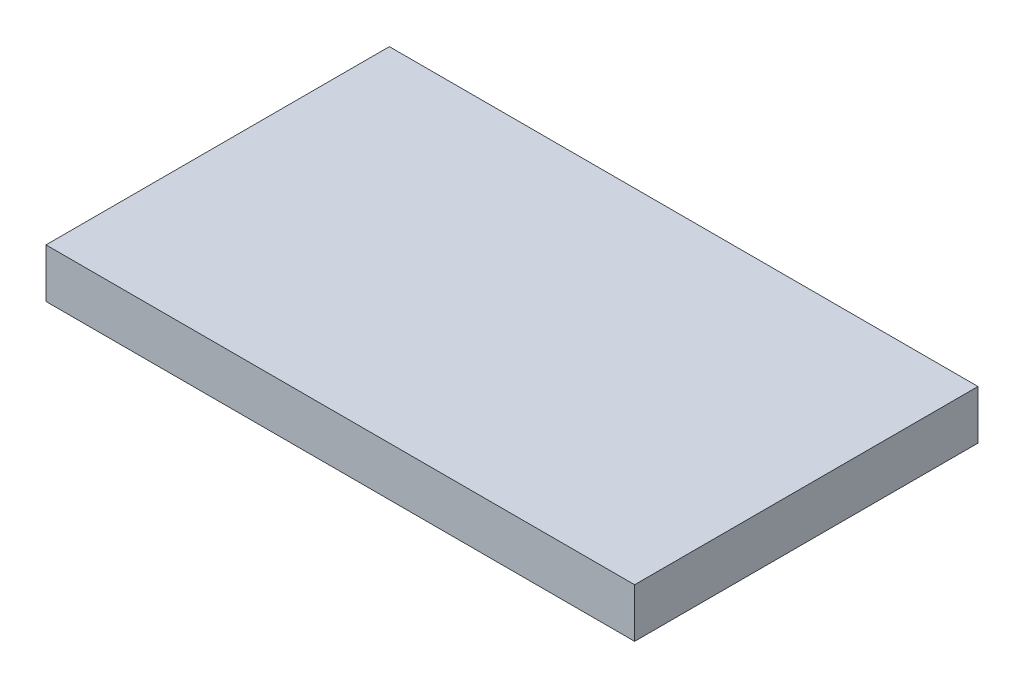
ISO-10303-21;
HEADER;
FILE_DESCRIPTION(('STEP AP214'),'2;1');
FILE_NAME('part.step','',(''),(''),'','','');
FILE_SCHEMA(('AUTOMOTIVE_DESIGN { 1 0 10303 214 1 1 1 1 }'));
ENDSEC;
DATA;
#1=APPLICATION_CONTEXT('core data for automotive mechanical design processes');
#2=APPLICATION_PROTOCOL_DEFINITION('international standard','automotive_design',2000,#1);
#3=PRODUCT_CONTEXT('',#1,'mechanical');
#4=PRODUCT('Part','Part','',(#3));
#5=PRODUCT_RELATED_PRODUCT_CATEGORY('part','',(#4));
#6=PRODUCT_DEFINITION_FORMATION('','',#4);
#7=PRODUCT_DEFINITION_CONTEXT('part definition',#1,'design');
#8=PRODUCT_DEFINITION('design','',#6,#7);
#9=PRODUCT_DEFINITION_SHAPE('','',#8);
#10=(LENGTH_UNIT() NAMED_UNIT(*) SI_UNIT(.MILLI.,.METRE.));
#11=(NAMED_UNIT(*) PLANE_ANGLE_UNIT() SI_UNIT($,.RADIAN.));
#12=(NAMED_UNIT(*) SI_UNIT($,.STERADIAN.) SOLID_ANGLE_UNIT());
#13=UNCERTAINTY_MEASURE_WITH_UNIT(LENGTH_MEASURE(1.E-05),#10,'distance_accuracy_value','');
#14=(GEOMETRIC_REPRESENTATION_CONTEXT(3) GLOBAL_UNCERTAINTY_ASSIGNED_CONTEXT((#13)) GLOBAL_UNIT_ASSIGNED_CONTEXT((#10,
#11,#12)) REPRESENTATION_CONTEXT('',''));
#15=CARTESIAN_POINT('',(0.,0.,0.));
#16=DIRECTION('',(0.,0.,1.));
#17=DIRECTION('',(1.,0.,0.));
#18=AXIS2_PLACEMENT_3D('',#15,#16,#17);
#19=CARTESIAN_POINT('',(0.,25.4,0.));
#20=DIRECTION('',(1.,0.,0.));
#21=DIRECTION('',(0.,0.,-1.));
#22=AXIS2_PLACEMENT_3D('',#19,#20,#21);
#23=PLANE('',#22);
#24=DIRECTION('',(0.,0.,1.));
#25=VECTOR('',#24,1.);
#26=CARTESIAN_POINT('',(0.,0.,0.));
#27=LINE('',#26,#25);
#28=CARTESIAN_POINT('',(0.,0.,-177.8));
#29=VERTEX_POINT('',#28);
#30=CARTESIAN_POINT('',(0.,0.,0.));
#31=VERTEX_POINT('',#30);
#32=EDGE_CURVE('E80',#29,#31,#27,.T.);
#33=ORIENTED_EDGE('',*,*,#32,.T.);
#34=DIRECTION('',(0.,-1.,0.));
#35=VECTOR('',#34,1.);
#36=CARTESIAN_POINT('',(0.,25.4,0.));
#37=LINE('',#36,#35);
#38=CARTESIAN_POINT('',(0.,25.4,0.));
#39=VERTEX_POINT('',#38);
#40=EDGE_CURVE('E11',#39,#31,#37,.T.);
#41=ORIENTED_EDGE('',*,*,#40,.F.);
#42=DIRECTION('',(0.,0.,1.));
#43=VECTOR('',#42,1.);
#44=CARTESIAN_POINT('',(0.,25.4,0.));
#45=LINE('',#44,#43);
#46=CARTESIAN_POINT('',(0.,25.4,-177.8));
#47=VERTEX_POINT('',#46);
#48=EDGE_CURVE('E68',#47,#39,#45,.T.);
#49=ORIENTED_EDGE('',*,*,#48,.F.);
#50=DIRECTION('',(0.,-1.,0.));
#51=VECTOR('',#50,1.);
#52=CARTESIAN_POINT('',(0.,25.4,-177.8));
#53=LINE('',#52,#51);
#54=EDGE_CURVE('E76',#47,#29,#53,.T.);
#55=ORIENTED_EDGE('',*,*,#54,.T.);
#56=EDGE_LOOP('',(#33,#41,#49,#55));
#57=FACE_BOUND('',#56,.T.);
#58=ADVANCED_FACE('F17',(#57),#23,.F.);
#59=CARTESIAN_POINT('',(0.,25.4,0.));
#60=DIRECTION('',(0.,0.,-1.));
#61=DIRECTION('',(-1.,0.,0.));
#62=AXIS2_PLACEMENT_3D('',#59,#60,#61);
#63=PLANE('',#62);
#64=DIRECTION('',(1.,0.,0.));
#65=VECTOR('',#64,1.);
#66=CARTESIAN_POINT('',(0.,0.,0.));
#67=LINE('',#66,#65);
#68=CARTESIAN_POINT('',(304.8,0.,0.));
#69=VERTEX_POINT('',#68);
#70=EDGE_CURVE('E72',#31,#69,#67,.T.);
#71=ORIENTED_EDGE('',*,*,#70,.T.);
#72=DIRECTION('',(0.,-1.,0.));
#73=VECTOR('',#72,1.);
#74=CARTESIAN_POINT('',(304.8,25.4,0.));
#75=LINE('',#74,#73);
#76=CARTESIAN_POINT('',(304.8,25.4,0.));
#77=VERTEX_POINT('',#76);
#78=EDGE_CURVE('E25',#77,#69,#75,.T.);
#79=ORIENTED_EDGE('',*,*,#78,.F.);
#80=DIRECTION('',(1.,0.,0.));
#81=VECTOR('',#80,1.);
#82=CARTESIAN_POINT('',(0.,25.4,0.));
#83=LINE('',#82,#81);
#84=EDGE_CURVE('E63',#39,#77,#83,.T.);
#85=ORIENTED_EDGE('',*,*,#84,.F.);
#86=ORIENTED_EDGE('',*,*,#40,.T.);
#87=EDGE_LOOP('',(#71,#79,#85,#86));
#88=FACE_BOUND('',#87,.T.);
#89=ADVANCED_FACE('F71',(#88),#63,.F.);
#90=CARTESIAN_POINT('',(304.8,25.4,0.));
#91=DIRECTION('',(-1.,0.,0.));
#92=DIRECTION('',(0.,0.,1.));
#93=AXIS2_PLACEMENT_3D('',#90,#91,#92);
#94=PLANE('',#93);
#95=DIRECTION('',(0.,0.,-1.));
#96=VECTOR('',#95,1.);
#97=CARTESIAN_POINT('',(304.8,0.,0.));
#98=LINE('',#97,#96);
#99=CARTESIAN_POINT('',(304.8,0.,-177.8));
#100=VERTEX_POINT('',#99);
#101=EDGE_CURVE('E50',#69,#100,#98,.T.);
#102=ORIENTED_EDGE('',*,*,#101,.T.);
#103=DIRECTION('',(0.,-1.,0.));
#104=VECTOR('',#103,1.);
#105=CARTESIAN_POINT('',(304.8,25.4,-177.8));
#106=LINE('',#105,#104);
#107=CARTESIAN_POINT('',(304.8,25.4,-177.8));
#108=VERTEX_POINT('',#107);
#109=EDGE_CURVE('E73',#108,#100,#106,.T.);
#110=ORIENTED_EDGE('',*,*,#109,.F.);
#111=DIRECTION('',(0.,0.,-1.));
#112=VECTOR('',#111,1.);
#113=CARTESIAN_POINT('',(304.8,25.4,0.));
#114=LINE('',#113,#112);
#115=EDGE_CURVE('E66',#77,#108,#114,.T.);
#116=ORIENTED_EDGE('',*,*,#115,.F.);
#117=ORIENTED_EDGE('',*,*,#78,.T.);
#118=EDGE_LOOP('',(#102,#110,#116,#117));
#119=FACE_BOUND('',#118,.T.);
#120=ADVANCED_FACE('F74',(#119),#94,.F.);
#121=CARTESIAN_POINT('',(0.,25.4,-177.8));
#122=DIRECTION('',(0.,0.,1.));
#123=DIRECTION('',(1.,0.,0.));
#124=AXIS2_PLACEMENT_3D('',#121,#122,#123);
#125=PLANE('',#124);
#126=DIRECTION('',(-1.,0.,0.));
#127=VECTOR('',#126,1.);
#128=CARTESIAN_POINT('',(0.,0.,-177.8));
#129=LINE('',#128,#127);
#130=EDGE_CURVE('E56',#100,#29,#129,.T.);
#131=ORIENTED_EDGE('',*,*,#130,.T.);
#132=ORIENTED_EDGE('',*,*,#54,.F.);
#133=DIRECTION('',(-1.,0.,0.));
#134=VECTOR('',#133,1.);
#135=CARTESIAN_POINT('',(0.,25.4,-177.8));
#136=LINE('',#135,#134);
#137=EDGE_CURVE('E33',#108,#47,#136,.T.);
#138=ORIENTED_EDGE('',*,*,#137,.F.);
#139=ORIENTED_EDGE('',*,*,#109,.T.);
#140=EDGE_LOOP('',(#131,#132,#138,#139));
#141=FACE_BOUND('',#140,.T.);
#142=ADVANCED_FACE('F87',(#141),#125,.F.);
#143=CARTESIAN_POINT('',(0.,25.4,-177.8));
#144=DIRECTION('',(0.,-1.,0.));
#145=DIRECTION('',(0.,0.,-1.));
#146=AXIS2_PLACEMENT_3D('',#143,#144,#145);
#147=PLANE('',#146);
#148=ORIENTED_EDGE('',*,*,#48,.T.);
#149=ORIENTED_EDGE('',*,*,#84,.T.);
#150=ORIENTED_EDGE('',*,*,#115,.T.);
#151=ORIENTED_EDGE('',*,*,#137,.T.);
#152=EDGE_LOOP('',(#148,#149,#150,#151));
#153=FACE_BOUND('',#152,.T.);
#154=ADVANCED_FACE('F64',(#153),#147,.F.);
#155=CARTESIAN_POINT('',(0.,0.,-177.8));
#156=DIRECTION('',(0.,-1.,0.));
#157=DIRECTION('',(0.,0.,-1.));
#158=AXIS2_PLACEMENT_3D('',#155,#156,#157);
#159=PLANE('',#158);
#160=ORIENTED_EDGE('',*,*,#32,.F.);
#161=ORIENTED_EDGE('',*,*,#130,.F.);
#162=ORIENTED_EDGE('',*,*,#101,.F.);
#163=ORIENTED_EDGE('',*,*,#70,.F.);
#164=EDGE_LOOP('',(#160,#161,#162,#163));
#165=FACE_BOUND('',#164,.T.);
#166=ADVANCED_FACE('F90',(#165),#159,.T.);
#167=CLOSED_SHELL('',(#58,#89,#120,#142,#154,#166));
#168=MANIFOLD_SOLID_BREP('B1',#167);
#169=ADVANCED_BREP_SHAPE_REPRESENTATION('',(#18,#168),#14);
#170=SHAPE_DEFINITION_REPRESENTATION(#9,#169);
ENDSEC;
END-ISO-10303-21;
